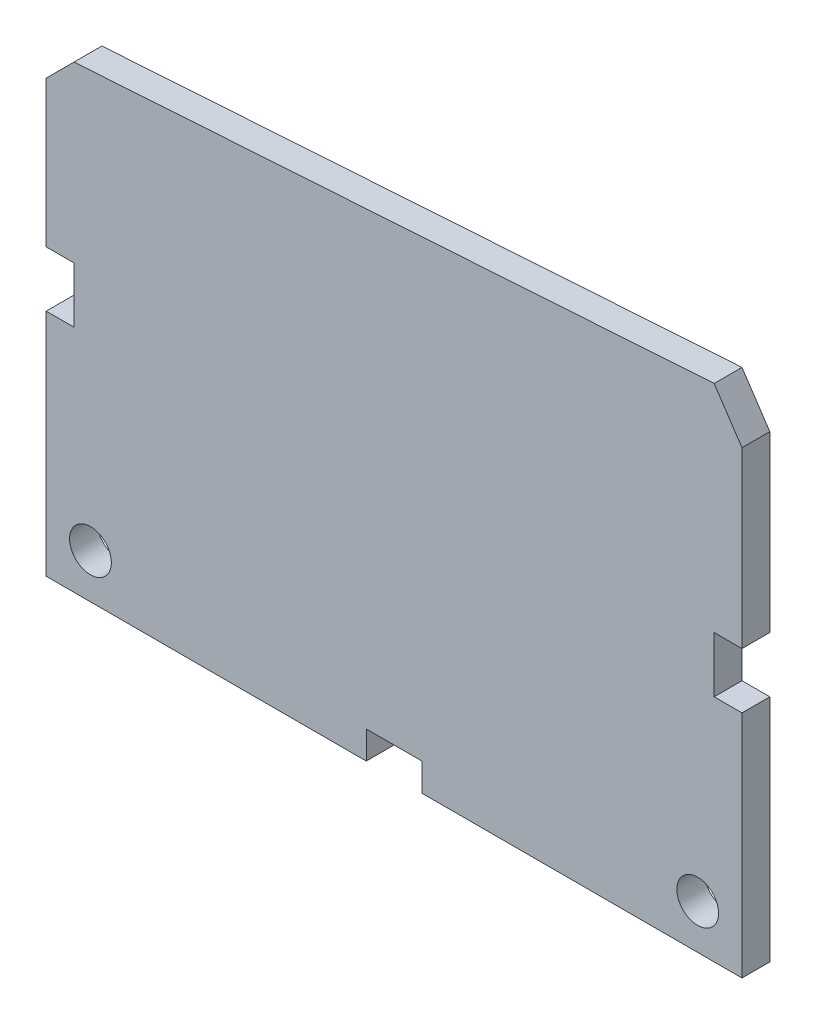
ISO-10303-21;
HEADER;
FILE_DESCRIPTION(('STEP AP214'),'2;1');
FILE_NAME('part.step','',(''),(''),'','','');
FILE_SCHEMA(('AUTOMOTIVE_DESIGN { 1 0 10303 214 1 1 1 1 }'));
ENDSEC;
DATA;
#1=APPLICATION_CONTEXT('core data for automotive mechanical design processes');
#2=APPLICATION_PROTOCOL_DEFINITION('international standard','automotive_design',2000,#1);
#3=PRODUCT_CONTEXT('',#1,'mechanical');
#4=PRODUCT('Part','Part','',(#3));
#5=PRODUCT_RELATED_PRODUCT_CATEGORY('part','',(#4));
#6=PRODUCT_DEFINITION_FORMATION('','',#4);
#7=PRODUCT_DEFINITION_CONTEXT('part definition',#1,'design');
#8=PRODUCT_DEFINITION('design','',#6,#7);
#9=PRODUCT_DEFINITION_SHAPE('','',#8);
#10=(LENGTH_UNIT() NAMED_UNIT(*) SI_UNIT(.MILLI.,.METRE.));
#11=(NAMED_UNIT(*) PLANE_ANGLE_UNIT() SI_UNIT($,.RADIAN.));
#12=(NAMED_UNIT(*) SI_UNIT($,.STERADIAN.) SOLID_ANGLE_UNIT());
#13=UNCERTAINTY_MEASURE_WITH_UNIT(LENGTH_MEASURE(1.E-05),#10,'distance_accuracy_value','');
#14=(GEOMETRIC_REPRESENTATION_CONTEXT(3) GLOBAL_UNCERTAINTY_ASSIGNED_CONTEXT((#13)) GLOBAL_UNIT_ASSIGNED_CONTEXT((#10,
#11,#12)) REPRESENTATION_CONTEXT('',''));
#15=CARTESIAN_POINT('',(0.,0.,0.));
#16=DIRECTION('',(0.,0.,1.));
#17=DIRECTION('',(1.,0.,0.));
#18=AXIS2_PLACEMENT_3D('',#15,#16,#17);
#19=CARTESIAN_POINT('',(50.,-33.,24.));
#20=DIRECTION('',(-1.,0.,0.));
#21=DIRECTION('',(0.,0.,1.));
#22=AXIS2_PLACEMENT_3D('',#19,#20,#21);
#23=PLANE('',#22);
#24=DIRECTION('',(0.,1.,0.));
#25=VECTOR('',#24,1.);
#26=CARTESIAN_POINT('',(50.,-33.,22.));
#27=LINE('',#26,#25);
#28=CARTESIAN_POINT('',(50.,-33.,22.));
#29=VERTEX_POINT('',#28);
#30=CARTESIAN_POINT('',(50.,-16.5,22.));
#31=VERTEX_POINT('',#30);
#32=EDGE_CURVE('E4459',#29,#31,#27,.T.);
#33=ORIENTED_EDGE('',*,*,#32,.T.);
#34=DIRECTION('',(0.,0.,1.));
#35=VECTOR('',#34,1.);
#36=CARTESIAN_POINT('',(50.,-16.5,22.));
#37=LINE('',#36,#35);
#38=CARTESIAN_POINT('',(50.,-16.5,24.));
#39=VERTEX_POINT('',#38);
#40=EDGE_CURVE('E4355',#31,#39,#37,.T.);
#41=ORIENTED_EDGE('',*,*,#40,.T.);
#42=DIRECTION('',(0.,1.,0.));
#43=VECTOR('',#42,1.);
#44=CARTESIAN_POINT('',(50.,-33.,24.));
#45=LINE('',#44,#43);
#46=CARTESIAN_POINT('',(50.,-33.,24.));
#47=VERTEX_POINT('',#46);
#48=EDGE_CURVE('E4438',#47,#39,#45,.T.);
#49=ORIENTED_EDGE('',*,*,#48,.F.);
#50=DIRECTION('',(0.,0.,-1.));
#51=VECTOR('',#50,1.);
#52=CARTESIAN_POINT('',(50.,-33.,24.));
#53=LINE('',#52,#51);
#54=EDGE_CURVE('E4310',#47,#29,#53,.T.);
#55=ORIENTED_EDGE('',*,*,#54,.T.);
#56=EDGE_LOOP('',(#33,#41,#49,#55));
#57=FACE_BOUND('',#56,.T.);
#58=ADVANCED_FACE('F4140',(#57),#23,.F.);
#59=CARTESIAN_POINT('',(0.,-2.00000000000001,24.));
#60=DIRECTION('',(1.,0.,0.));
#61=DIRECTION('',(0.,1.,0.));
#62=AXIS2_PLACEMENT_3D('',#59,#60,#61);
#63=PLANE('',#62);
#64=DIRECTION('',(0.,-1.,0.));
#65=VECTOR('',#64,1.);
#66=CARTESIAN_POINT('',(0.,-2.00000000000001,22.));
#67=LINE('',#66,#65);
#68=CARTESIAN_POINT('',(0.,-2.00000000000001,22.));
#69=VERTEX_POINT('',#68);
#70=CARTESIAN_POINT('',(0.,-12.5,22.));
#71=VERTEX_POINT('',#70);
#72=EDGE_CURVE('E4296',#69,#71,#67,.T.);
#73=ORIENTED_EDGE('',*,*,#72,.T.);
#74=DIRECTION('',(0.,0.,1.));
#75=VECTOR('',#74,1.);
#76=CARTESIAN_POINT('',(0.,-12.5,22.));
#77=LINE('',#76,#75);
#78=CARTESIAN_POINT('',(0.,-12.5,24.));
#79=VERTEX_POINT('',#78);
#80=EDGE_CURVE('E4361',#71,#79,#77,.T.);
#81=ORIENTED_EDGE('',*,*,#80,.T.);
#82=DIRECTION('',(0.,-1.,0.));
#83=VECTOR('',#82,1.);
#84=CARTESIAN_POINT('',(0.,-2.00000000000001,24.));
#85=LINE('',#84,#83);
#86=CARTESIAN_POINT('',(0.,-2.00000000000001,24.));
#87=VERTEX_POINT('',#86);
#88=EDGE_CURVE('E4451',#87,#79,#85,.T.);
#89=ORIENTED_EDGE('',*,*,#88,.F.);
#90=DIRECTION('',(0.,0.,-1.));
#91=VECTOR('',#90,1.);
#92=CARTESIAN_POINT('',(0.,-2.00000000000001,24.));
#93=LINE('',#92,#91);
#94=EDGE_CURVE('E4318',#87,#69,#93,.T.);
#95=ORIENTED_EDGE('',*,*,#94,.T.);
#96=EDGE_LOOP('',(#73,#81,#89,#95));
#97=FACE_BOUND('',#96,.T.);
#98=ADVANCED_FACE('F4481',(#97),#63,.F.);
#99=CARTESIAN_POINT('',(0.,-33.,24.));
#100=DIRECTION('',(0.,1.,0.));
#101=DIRECTION('',(0.,0.,1.));
#102=AXIS2_PLACEMENT_3D('',#99,#100,#101);
#103=PLANE('',#102);
#104=DIRECTION('',(1.,0.,0.));
#105=VECTOR('',#104,1.);
#106=CARTESIAN_POINT('',(0.,-33.,22.));
#107=LINE('',#106,#105);
#108=CARTESIAN_POINT('',(0.,-33.,22.));
#109=VERTEX_POINT('',#108);
#110=CARTESIAN_POINT('',(23.,-33.,22.));
#111=VERTEX_POINT('',#110);
#112=EDGE_CURVE('E4294',#109,#111,#107,.T.);
#113=ORIENTED_EDGE('',*,*,#112,.T.);
#114=DIRECTION('',(0.,0.,1.));
#115=VECTOR('',#114,1.);
#116=CARTESIAN_POINT('',(23.,-33.,22.));
#117=LINE('',#116,#115);
#118=CARTESIAN_POINT('',(23.,-33.,24.));
#119=VERTEX_POINT('',#118);
#120=EDGE_CURVE('E4388',#111,#119,#117,.T.);
#121=ORIENTED_EDGE('',*,*,#120,.T.);
#122=DIRECTION('',(1.,0.,0.));
#123=VECTOR('',#122,1.);
#124=CARTESIAN_POINT('',(0.,-33.,24.));
#125=LINE('',#124,#123);
#126=CARTESIAN_POINT('',(0.,-33.,24.));
#127=VERTEX_POINT('',#126);
#128=EDGE_CURVE('E4315',#127,#119,#125,.T.);
#129=ORIENTED_EDGE('',*,*,#128,.F.);
#130=DIRECTION('',(0.,0.,-1.));
#131=VECTOR('',#130,1.);
#132=CARTESIAN_POINT('',(0.,-33.,24.));
#133=LINE('',#132,#131);
#134=EDGE_CURVE('E4314',#127,#109,#133,.T.);
#135=ORIENTED_EDGE('',*,*,#134,.T.);
#136=EDGE_LOOP('',(#113,#121,#129,#135));
#137=FACE_BOUND('',#136,.T.);
#138=ADVANCED_FACE('F4531',(#137),#103,.F.);
#139=CARTESIAN_POINT('',(50.,-12.5,24.));
#140=VERTEX_POINT('',#139);
#141=CARTESIAN_POINT('',(50.,0.,24.));
#142=VERTEX_POINT('',#141);
#143=EDGE_CURVE('E4309',#140,#142,#45,.T.);
#144=ORIENTED_EDGE('',*,*,#143,.F.);
#145=DIRECTION('',(0.,0.,1.));
#146=VECTOR('',#145,1.);
#147=CARTESIAN_POINT('',(50.,-12.5,22.));
#148=LINE('',#147,#146);
#149=CARTESIAN_POINT('',(50.,-12.5,22.));
#150=VERTEX_POINT('',#149);
#151=EDGE_CURVE('E4382',#150,#140,#148,.T.);
#152=ORIENTED_EDGE('',*,*,#151,.F.);
#153=CARTESIAN_POINT('',(50.,0.,22.));
#154=VERTEX_POINT('',#153);
#155=EDGE_CURVE('E4365',#150,#154,#27,.T.);
#156=ORIENTED_EDGE('',*,*,#155,.T.);
#157=DIRECTION('',(0.,0.,-1.));
#158=VECTOR('',#157,1.);
#159=CARTESIAN_POINT('',(50.,0.,24.));
#160=LINE('',#159,#158);
#161=EDGE_CURVE('E13',#142,#154,#160,.T.);
#162=ORIENTED_EDGE('',*,*,#161,.F.);
#163=EDGE_LOOP('',(#144,#152,#156,#162));
#164=FACE_BOUND('',#163,.T.);
#165=ADVANCED_FACE('F4142',(#164),#23,.F.);
#166=CARTESIAN_POINT('',(50.,0.,24.));
#167=DIRECTION('',(-0.832050294337843,-0.554700196225229,0.));
#168=DIRECTION('',(0.554700196225229,-0.832050294337843,0.));
#169=AXIS2_PLACEMENT_3D('',#166,#167,#168);
#170=PLANE('',#169);
#171=DIRECTION('',(-0.554700196225229,0.832050294337843,0.));
#172=VECTOR('',#171,1.);
#173=CARTESIAN_POINT('',(50.,0.,22.));
#174=LINE('',#173,#172);
#175=CARTESIAN_POINT('',(48.,3.,22.));
#176=VERTEX_POINT('',#175);
#177=EDGE_CURVE('E4463',#154,#176,#174,.T.);
#178=ORIENTED_EDGE('',*,*,#177,.T.);
#179=DIRECTION('',(0.,0.,-1.));
#180=VECTOR('',#179,1.);
#181=CARTESIAN_POINT('',(48.,3.,24.));
#182=LINE('',#181,#180);
#183=CARTESIAN_POINT('',(48.,3.,24.));
#184=VERTEX_POINT('',#183);
#185=EDGE_CURVE('E4150',#184,#176,#182,.T.);
#186=ORIENTED_EDGE('',*,*,#185,.F.);
#187=DIRECTION('',(-0.554700196225229,0.832050294337843,0.));
#188=VECTOR('',#187,1.);
#189=CARTESIAN_POINT('',(50.,0.,24.));
#190=LINE('',#189,#188);
#191=EDGE_CURVE('E4442',#142,#184,#190,.T.);
#192=ORIENTED_EDGE('',*,*,#191,.F.);
#193=ORIENTED_EDGE('',*,*,#161,.T.);
#194=EDGE_LOOP('',(#178,#186,#192,#193));
#195=FACE_BOUND('',#194,.T.);
#196=ADVANCED_FACE('F4492',(#195),#170,.F.);
#197=CARTESIAN_POINT('',(48.,3.,24.));
#198=DIRECTION('',(0.0650791373455969,-0.997880105965818,0.));
#199=DIRECTION('',(0.997880105965818,0.0650791373455969,0.));
#200=AXIS2_PLACEMENT_3D('',#197,#198,#199);
#201=PLANE('',#200);
#202=DIRECTION('',(-0.997880105965818,-0.0650791373455969,0.));
#203=VECTOR('',#202,1.);
#204=CARTESIAN_POINT('',(48.,3.,22.));
#205=LINE('',#204,#203);
#206=CARTESIAN_POINT('',(2.,0.,22.));
#207=VERTEX_POINT('',#206);
#208=EDGE_CURVE('E4303',#176,#207,#205,.T.);
#209=ORIENTED_EDGE('',*,*,#208,.T.);
#210=DIRECTION('',(0.,0.,-1.));
#211=VECTOR('',#210,1.);
#212=CARTESIAN_POINT('',(2.,0.,24.));
#213=LINE('',#212,#211);
#214=CARTESIAN_POINT('',(2.,0.,24.));
#215=VERTEX_POINT('',#214);
#216=EDGE_CURVE('E4322',#215,#207,#213,.T.);
#217=ORIENTED_EDGE('',*,*,#216,.F.);
#218=DIRECTION('',(-0.997880105965818,-0.0650791373455969,0.));
#219=VECTOR('',#218,1.);
#220=CARTESIAN_POINT('',(48.,3.,24.));
#221=LINE('',#220,#219);
#222=EDGE_CURVE('E4445',#184,#215,#221,.T.);
#223=ORIENTED_EDGE('',*,*,#222,.F.);
#224=ORIENTED_EDGE('',*,*,#185,.T.);
#225=EDGE_LOOP('',(#209,#217,#223,#224));
#226=FACE_BOUND('',#225,.T.);
#227=ADVANCED_FACE('F4469',(#226),#201,.F.);
#228=CARTESIAN_POINT('',(2.,0.,24.));
#229=DIRECTION('',(0.707106781186549,-0.707106781186546,0.));
#230=DIRECTION('',(0.707106781186546,0.707106781186549,0.));
#231=AXIS2_PLACEMENT_3D('',#228,#229,#230);
#232=PLANE('',#231);
#233=DIRECTION('',(-0.707106781186546,-0.707106781186549,0.));
#234=VECTOR('',#233,1.);
#235=CARTESIAN_POINT('',(2.,0.,22.));
#236=LINE('',#235,#234);
#237=EDGE_CURVE('E4297',#207,#69,#236,.T.);
#238=ORIENTED_EDGE('',*,*,#237,.T.);
#239=ORIENTED_EDGE('',*,*,#94,.F.);
#240=DIRECTION('',(-0.707106781186546,-0.707106781186549,0.));
#241=VECTOR('',#240,1.);
#242=CARTESIAN_POINT('',(2.,0.,24.));
#243=LINE('',#242,#241);
#244=EDGE_CURVE('E4448',#215,#87,#243,.T.);
#245=ORIENTED_EDGE('',*,*,#244,.F.);
#246=ORIENTED_EDGE('',*,*,#216,.T.);
#247=EDGE_LOOP('',(#238,#239,#245,#246));
#248=FACE_BOUND('',#247,.T.);
#249=ADVANCED_FACE('F4476',(#248),#232,.F.);
#250=CARTESIAN_POINT('',(0.,-16.5,24.));
#251=VERTEX_POINT('',#250);
#252=EDGE_CURVE('E4285',#251,#127,#85,.T.);
#253=ORIENTED_EDGE('',*,*,#252,.F.);
#254=DIRECTION('',(0.,0.,1.));
#255=VECTOR('',#254,1.);
#256=CARTESIAN_POINT('',(0.,-16.5,22.));
#257=LINE('',#256,#255);
#258=CARTESIAN_POINT('',(0.,-16.5,22.));
#259=VERTEX_POINT('',#258);
#260=EDGE_CURVE('E4271',#259,#251,#257,.T.);
#261=ORIENTED_EDGE('',*,*,#260,.F.);
#262=EDGE_CURVE('E4283',#259,#109,#67,.T.);
#263=ORIENTED_EDGE('',*,*,#262,.T.);
#264=ORIENTED_EDGE('',*,*,#134,.F.);
#265=EDGE_LOOP('',(#253,#261,#263,#264));
#266=FACE_BOUND('',#265,.T.);
#267=ADVANCED_FACE('F4281',(#266),#63,.F.);
#268=CARTESIAN_POINT('',(27.,-33.,24.));
#269=VERTEX_POINT('',#268);
#270=EDGE_CURVE('E4455',#269,#47,#125,.T.);
#271=ORIENTED_EDGE('',*,*,#270,.F.);
#272=DIRECTION('',(0.,0.,1.));
#273=VECTOR('',#272,1.);
#274=CARTESIAN_POINT('',(27.,-33.,22.));
#275=LINE('',#274,#273);
#276=CARTESIAN_POINT('',(27.,-33.,22.));
#277=VERTEX_POINT('',#276);
#278=EDGE_CURVE('E4417',#277,#269,#275,.T.);
#279=ORIENTED_EDGE('',*,*,#278,.F.);
#280=EDGE_CURVE('E4302',#277,#29,#107,.T.);
#281=ORIENTED_EDGE('',*,*,#280,.T.);
#282=ORIENTED_EDGE('',*,*,#54,.F.);
#283=EDGE_LOOP('',(#271,#279,#281,#282));
#284=FACE_BOUND('',#283,.T.);
#285=ADVANCED_FACE('F4512',(#284),#103,.F.);
#286=CARTESIAN_POINT('',(0.,0.,24.));
#287=DIRECTION('',(0.,0.,-1.));
#288=DIRECTION('',(-1.,0.,0.));
#289=AXIS2_PLACEMENT_3D('',#286,#287,#288);
#290=PLANE('',#289);
#291=CARTESIAN_POINT('',(3.18198051533946,-29.8180194846605,24.));
#292=DIRECTION('',(0.,0.,1.));
#293=DIRECTION('',(1.,0.,0.));
#294=AXIS2_PLACEMENT_3D('',#291,#292,#293);
#295=CIRCLE('',#294,1.5);
#296=CARTESIAN_POINT('',(4.68198051533946,-29.8180194846605,24.));
#297=VERTEX_POINT('',#296);
#298=EDGE_CURVE('E4331',#297,#297,#295,.T.);
#299=ORIENTED_EDGE('',*,*,#298,.F.);
#300=EDGE_LOOP('',(#299));
#301=FACE_BOUND('',#300,.T.);
#302=CARTESIAN_POINT('',(46.8180194846605,-29.8180194846605,24.));
#303=DIRECTION('',(0.,0.,1.));
#304=DIRECTION('',(-1.,0.,0.));
#305=AXIS2_PLACEMENT_3D('',#302,#303,#304);
#306=CIRCLE('',#305,1.5);
#307=CARTESIAN_POINT('',(45.3180194846605,-29.8180194846605,24.));
#308=VERTEX_POINT('',#307);
#309=EDGE_CURVE('E4339',#308,#308,#306,.T.);
#310=ORIENTED_EDGE('',*,*,#309,.F.);
#311=EDGE_LOOP('',(#310));
#312=FACE_BOUND('',#311,.T.);
#313=ORIENTED_EDGE('',*,*,#88,.T.);
#314=DIRECTION('',(-1.,0.,0.));
#315=VECTOR('',#314,1.);
#316=CARTESIAN_POINT('',(0.,-12.5,24.));
#317=LINE('',#316,#315);
#318=CARTESIAN_POINT('',(2.,-12.5,24.));
#319=VERTEX_POINT('',#318);
#320=EDGE_CURVE('E4277',#319,#79,#317,.T.);
#321=ORIENTED_EDGE('',*,*,#320,.F.);
#322=DIRECTION('',(0.,1.,0.));
#323=VECTOR('',#322,1.);
#324=CARTESIAN_POINT('',(2.,-12.5,24.));
#325=LINE('',#324,#323);
#326=CARTESIAN_POINT('',(2.,-16.5,24.));
#327=VERTEX_POINT('',#326);
#328=EDGE_CURVE('E4354',#327,#319,#325,.T.);
#329=ORIENTED_EDGE('',*,*,#328,.F.);
#330=DIRECTION('',(1.,0.,0.));
#331=VECTOR('',#330,1.);
#332=CARTESIAN_POINT('',(0.,-16.5,24.));
#333=LINE('',#332,#331);
#334=EDGE_CURVE('E4351',#251,#327,#333,.T.);
#335=ORIENTED_EDGE('',*,*,#334,.F.);
#336=ORIENTED_EDGE('',*,*,#252,.T.);
#337=ORIENTED_EDGE('',*,*,#128,.T.);
#338=DIRECTION('',(0.,-1.,0.));
#339=VECTOR('',#338,1.);
#340=CARTESIAN_POINT('',(23.,-31.,24.));
#341=LINE('',#340,#339);
#342=CARTESIAN_POINT('',(23.,-31.,24.));
#343=VERTEX_POINT('',#342);
#344=EDGE_CURVE('E4410',#343,#119,#341,.T.);
#345=ORIENTED_EDGE('',*,*,#344,.F.);
#346=DIRECTION('',(-1.,0.,0.));
#347=VECTOR('',#346,1.);
#348=CARTESIAN_POINT('',(27.,-31.,24.));
#349=LINE('',#348,#347);
#350=CARTESIAN_POINT('',(27.,-31.,24.));
#351=VERTEX_POINT('',#350);
#352=EDGE_CURVE('E4421',#351,#343,#349,.T.);
#353=ORIENTED_EDGE('',*,*,#352,.F.);
#354=DIRECTION('',(0.,1.,0.));
#355=VECTOR('',#354,1.);
#356=CARTESIAN_POINT('',(27.,-33.,24.));
#357=LINE('',#356,#355);
#358=EDGE_CURVE('E4337',#269,#351,#357,.T.);
#359=ORIENTED_EDGE('',*,*,#358,.F.);
#360=ORIENTED_EDGE('',*,*,#270,.T.);
#361=ORIENTED_EDGE('',*,*,#48,.T.);
#362=DIRECTION('',(1.,0.,0.));
#363=VECTOR('',#362,1.);
#364=CARTESIAN_POINT('',(50.,-16.5,24.));
#365=LINE('',#364,#363);
#366=CARTESIAN_POINT('',(48.,-16.5,24.));
#367=VERTEX_POINT('',#366);
#368=EDGE_CURVE('E4375',#367,#39,#365,.T.);
#369=ORIENTED_EDGE('',*,*,#368,.F.);
#370=DIRECTION('',(0.,-1.,0.));
#371=VECTOR('',#370,1.);
#372=CARTESIAN_POINT('',(48.,-12.5,24.));
#373=LINE('',#372,#371);
#374=CARTESIAN_POINT('',(48.,-12.5,24.));
#375=VERTEX_POINT('',#374);
#376=EDGE_CURVE('E4387',#375,#367,#373,.T.);
#377=ORIENTED_EDGE('',*,*,#376,.F.);
#378=DIRECTION('',(-1.,0.,0.));
#379=VECTOR('',#378,1.);
#380=CARTESIAN_POINT('',(50.,-12.5,24.));
#381=LINE('',#380,#379);
#382=EDGE_CURVE('E4383',#140,#375,#381,.T.);
#383=ORIENTED_EDGE('',*,*,#382,.F.);
#384=ORIENTED_EDGE('',*,*,#143,.T.);
#385=ORIENTED_EDGE('',*,*,#191,.T.);
#386=ORIENTED_EDGE('',*,*,#222,.T.);
#387=ORIENTED_EDGE('',*,*,#244,.T.);
#388=EDGE_LOOP('',(#313,#321,#329,#335,#336,#337,#345,#353,#359,#360,#361,#369,#377,#383,#384,
#385,#386,#387));
#389=FACE_BOUND('',#388,.T.);
#390=ADVANCED_FACE('F4485',(#301,#312,#389),#290,.F.);
#391=CARTESIAN_POINT('',(0.,0.,22.));
#392=DIRECTION('',(0.,0.,-1.));
#393=DIRECTION('',(-1.,0.,0.));
#394=AXIS2_PLACEMENT_3D('',#391,#392,#393);
#395=PLANE('',#394);
#396=CARTESIAN_POINT('',(3.18198051533946,-29.8180194846605,22.));
#397=DIRECTION('',(0.,0.,-1.));
#398=DIRECTION('',(-1.,0.,0.));
#399=AXIS2_PLACEMENT_3D('',#396,#397,#398);
#400=CIRCLE('',#399,1.5);
#401=CARTESIAN_POINT('',(1.68198051533946,-29.8180194846605,22.));
#402=VERTEX_POINT('',#401);
#403=EDGE_CURVE('E4144',#402,#402,#400,.T.);
#404=ORIENTED_EDGE('',*,*,#403,.F.);
#405=EDGE_LOOP('',(#404));
#406=FACE_BOUND('',#405,.T.);
#407=CARTESIAN_POINT('',(46.8180194846605,-29.8180194846605,22.));
#408=DIRECTION('',(0.,0.,-1.));
#409=DIRECTION('',(-1.,0.,0.));
#410=AXIS2_PLACEMENT_3D('',#407,#408,#409);
#411=CIRCLE('',#410,1.5);
#412=CARTESIAN_POINT('',(45.3180194846605,-29.8180194846605,22.));
#413=VERTEX_POINT('',#412);
#414=EDGE_CURVE('E4328',#413,#413,#411,.T.);
#415=ORIENTED_EDGE('',*,*,#414,.F.);
#416=EDGE_LOOP('',(#415));
#417=FACE_BOUND('',#416,.T.);
#418=DIRECTION('',(-1.,0.,0.));
#419=VECTOR('',#418,1.);
#420=CARTESIAN_POINT('',(0.,-12.5,22.));
#421=LINE('',#420,#419);
#422=CARTESIAN_POINT('',(2.,-12.5,22.));
#423=VERTEX_POINT('',#422);
#424=EDGE_CURVE('E4287',#423,#71,#421,.T.);
#425=ORIENTED_EDGE('',*,*,#424,.T.);
#426=ORIENTED_EDGE('',*,*,#72,.F.);
#427=ORIENTED_EDGE('',*,*,#237,.F.);
#428=ORIENTED_EDGE('',*,*,#208,.F.);
#429=ORIENTED_EDGE('',*,*,#177,.F.);
#430=ORIENTED_EDGE('',*,*,#155,.F.);
#431=DIRECTION('',(-1.,0.,0.));
#432=VECTOR('',#431,1.);
#433=CARTESIAN_POINT('',(50.,-12.5,22.));
#434=LINE('',#433,#432);
#435=CARTESIAN_POINT('',(48.,-12.5,22.));
#436=VERTEX_POINT('',#435);
#437=EDGE_CURVE('E4371',#150,#436,#434,.T.);
#438=ORIENTED_EDGE('',*,*,#437,.T.);
#439=DIRECTION('',(0.,-1.,0.));
#440=VECTOR('',#439,1.);
#441=CARTESIAN_POINT('',(48.,-12.5,22.));
#442=LINE('',#441,#440);
#443=CARTESIAN_POINT('',(48.,-16.5,22.));
#444=VERTEX_POINT('',#443);
#445=EDGE_CURVE('E4166',#436,#444,#442,.T.);
#446=ORIENTED_EDGE('',*,*,#445,.T.);
#447=DIRECTION('',(1.,0.,0.));
#448=VECTOR('',#447,1.);
#449=CARTESIAN_POINT('',(50.,-16.5,22.));
#450=LINE('',#449,#448);
#451=EDGE_CURVE('E4378',#444,#31,#450,.T.);
#452=ORIENTED_EDGE('',*,*,#451,.T.);
#453=ORIENTED_EDGE('',*,*,#32,.F.);
#454=ORIENTED_EDGE('',*,*,#280,.F.);
#455=DIRECTION('',(0.,1.,0.));
#456=VECTOR('',#455,1.);
#457=CARTESIAN_POINT('',(27.,-33.,22.));
#458=LINE('',#457,#456);
#459=CARTESIAN_POINT('',(27.,-31.,22.));
#460=VERTEX_POINT('',#459);
#461=EDGE_CURVE('E4405',#277,#460,#458,.T.);
#462=ORIENTED_EDGE('',*,*,#461,.T.);
#463=DIRECTION('',(-1.,0.,0.));
#464=VECTOR('',#463,1.);
#465=CARTESIAN_POINT('',(27.,-31.,22.));
#466=LINE('',#465,#464);
#467=CARTESIAN_POINT('',(23.,-31.,22.));
#468=VERTEX_POINT('',#467);
#469=EDGE_CURVE('E4409',#460,#468,#466,.T.);
#470=ORIENTED_EDGE('',*,*,#469,.T.);
#471=DIRECTION('',(0.,-1.,0.));
#472=VECTOR('',#471,1.);
#473=CARTESIAN_POINT('',(23.,-31.,22.));
#474=LINE('',#473,#472);
#475=EDGE_CURVE('E4414',#468,#111,#474,.T.);
#476=ORIENTED_EDGE('',*,*,#475,.T.);
#477=ORIENTED_EDGE('',*,*,#112,.F.);
#478=ORIENTED_EDGE('',*,*,#262,.F.);
#479=DIRECTION('',(1.,0.,0.));
#480=VECTOR('',#479,1.);
#481=CARTESIAN_POINT('',(0.,-16.5,22.));
#482=LINE('',#481,#480);
#483=CARTESIAN_POINT('',(2.,-16.5,22.));
#484=VERTEX_POINT('',#483);
#485=EDGE_CURVE('E4267',#259,#484,#482,.T.);
#486=ORIENTED_EDGE('',*,*,#485,.T.);
#487=DIRECTION('',(0.,1.,0.));
#488=VECTOR('',#487,1.);
#489=CARTESIAN_POINT('',(2.,-12.5,22.));
#490=LINE('',#489,#488);
#491=EDGE_CURVE('E4158',#484,#423,#490,.T.);
#492=ORIENTED_EDGE('',*,*,#491,.T.);
#493=EDGE_LOOP('',(#425,#426,#427,#428,#429,#430,#438,#446,#452,#453,#454,#462,#470,#476,#477,
#478,#486,#492));
#494=FACE_BOUND('',#493,.T.);
#495=ADVANCED_FACE('F4291',(#406,#417,#494),#395,.T.);
#496=CARTESIAN_POINT('',(23.,-31.,22.));
#497=DIRECTION('',(-1.,0.,0.));
#498=DIRECTION('',(0.,0.,1.));
#499=AXIS2_PLACEMENT_3D('',#496,#497,#498);
#500=PLANE('',#499);
#501=ORIENTED_EDGE('',*,*,#344,.T.);
#502=ORIENTED_EDGE('',*,*,#120,.F.);
#503=ORIENTED_EDGE('',*,*,#475,.F.);
#504=DIRECTION('',(0.,0.,1.));
#505=VECTOR('',#504,1.);
#506=CARTESIAN_POINT('',(23.,-31.,22.));
#507=LINE('',#506,#505);
#508=EDGE_CURVE('E4430',#468,#343,#507,.T.);
#509=ORIENTED_EDGE('',*,*,#508,.T.);
#510=EDGE_LOOP('',(#501,#502,#503,#509));
#511=FACE_BOUND('',#510,.T.);
#512=ADVANCED_FACE('F4528',(#511),#500,.F.);
#513=CARTESIAN_POINT('',(27.,-31.,22.));
#514=DIRECTION('',(0.,1.,0.));
#515=DIRECTION('',(0.,0.,1.));
#516=AXIS2_PLACEMENT_3D('',#513,#514,#515);
#517=PLANE('',#516);
#518=ORIENTED_EDGE('',*,*,#352,.T.);
#519=ORIENTED_EDGE('',*,*,#508,.F.);
#520=ORIENTED_EDGE('',*,*,#469,.F.);
#521=DIRECTION('',(0.,0.,1.));
#522=VECTOR('',#521,1.);
#523=CARTESIAN_POINT('',(27.,-31.,22.));
#524=LINE('',#523,#522);
#525=EDGE_CURVE('E4433',#460,#351,#524,.T.);
#526=ORIENTED_EDGE('',*,*,#525,.T.);
#527=EDGE_LOOP('',(#518,#519,#520,#526));
#528=FACE_BOUND('',#527,.T.);
#529=ADVANCED_FACE('F4526',(#528),#517,.F.);
#530=CARTESIAN_POINT('',(27.,-33.,22.));
#531=DIRECTION('',(1.,0.,0.));
#532=DIRECTION('',(0.,0.,-1.));
#533=AXIS2_PLACEMENT_3D('',#530,#531,#532);
#534=PLANE('',#533);
#535=ORIENTED_EDGE('',*,*,#358,.T.);
#536=ORIENTED_EDGE('',*,*,#525,.F.);
#537=ORIENTED_EDGE('',*,*,#461,.F.);
#538=ORIENTED_EDGE('',*,*,#278,.T.);
#539=EDGE_LOOP('',(#535,#536,#537,#538));
#540=FACE_BOUND('',#539,.T.);
#541=ADVANCED_FACE('F4523',(#540),#534,.F.);
#542=CARTESIAN_POINT('',(50.,-16.5,22.));
#543=DIRECTION('',(0.,-1.,0.));
#544=DIRECTION('',(0.,0.,-1.));
#545=AXIS2_PLACEMENT_3D('',#542,#543,#544);
#546=PLANE('',#545);
#547=ORIENTED_EDGE('',*,*,#368,.T.);
#548=ORIENTED_EDGE('',*,*,#40,.F.);
#549=ORIENTED_EDGE('',*,*,#451,.F.);
#550=DIRECTION('',(0.,0.,1.));
#551=VECTOR('',#550,1.);
#552=CARTESIAN_POINT('',(48.,-16.5,22.));
#553=LINE('',#552,#551);
#554=EDGE_CURVE('E4397',#444,#367,#553,.T.);
#555=ORIENTED_EDGE('',*,*,#554,.T.);
#556=EDGE_LOOP('',(#547,#548,#549,#555));
#557=FACE_BOUND('',#556,.T.);
#558=ADVANCED_FACE('F4504',(#557),#546,.F.);
#559=CARTESIAN_POINT('',(48.,-12.5,22.));
#560=DIRECTION('',(-1.,0.,0.));
#561=DIRECTION('',(0.,0.,1.));
#562=AXIS2_PLACEMENT_3D('',#559,#560,#561);
#563=PLANE('',#562);
#564=ORIENTED_EDGE('',*,*,#376,.T.);
#565=ORIENTED_EDGE('',*,*,#554,.F.);
#566=ORIENTED_EDGE('',*,*,#445,.F.);
#567=DIRECTION('',(0.,0.,1.));
#568=VECTOR('',#567,1.);
#569=CARTESIAN_POINT('',(48.,-12.5,22.));
#570=LINE('',#569,#568);
#571=EDGE_CURVE('E4400',#436,#375,#570,.T.);
#572=ORIENTED_EDGE('',*,*,#571,.T.);
#573=EDGE_LOOP('',(#564,#565,#566,#572));
#574=FACE_BOUND('',#573,.T.);
#575=ADVANCED_FACE('F4501',(#574),#563,.F.);
#576=CARTESIAN_POINT('',(50.,-12.5,22.));
#577=DIRECTION('',(0.,1.,0.));
#578=DIRECTION('',(0.,0.,1.));
#579=AXIS2_PLACEMENT_3D('',#576,#577,#578);
#580=PLANE('',#579);
#581=ORIENTED_EDGE('',*,*,#382,.T.);
#582=ORIENTED_EDGE('',*,*,#571,.F.);
#583=ORIENTED_EDGE('',*,*,#437,.F.);
#584=ORIENTED_EDGE('',*,*,#151,.T.);
#585=EDGE_LOOP('',(#581,#582,#583,#584));
#586=FACE_BOUND('',#585,.T.);
#587=ADVANCED_FACE('F4498',(#586),#580,.F.);
#588=CARTESIAN_POINT('',(0.,-12.5,22.));
#589=DIRECTION('',(0.,1.,0.));
#590=DIRECTION('',(0.,0.,1.));
#591=AXIS2_PLACEMENT_3D('',#588,#589,#590);
#592=PLANE('',#591);
#593=ORIENTED_EDGE('',*,*,#320,.T.);
#594=ORIENTED_EDGE('',*,*,#80,.F.);
#595=ORIENTED_EDGE('',*,*,#424,.F.);
#596=DIRECTION('',(0.,0.,1.));
#597=VECTOR('',#596,1.);
#598=CARTESIAN_POINT('',(2.,-12.5,22.));
#599=LINE('',#598,#597);
#600=EDGE_CURVE('E4366',#423,#319,#599,.T.);
#601=ORIENTED_EDGE('',*,*,#600,.T.);
#602=EDGE_LOOP('',(#593,#594,#595,#601));
#603=FACE_BOUND('',#602,.T.);
#604=ADVANCED_FACE('F4534',(#603),#592,.F.);
#605=CARTESIAN_POINT('',(2.,-12.5,22.));
#606=DIRECTION('',(1.,0.,0.));
#607=DIRECTION('',(0.,0.,-1.));
#608=AXIS2_PLACEMENT_3D('',#605,#606,#607);
#609=PLANE('',#608);
#610=ORIENTED_EDGE('',*,*,#328,.T.);
#611=ORIENTED_EDGE('',*,*,#600,.F.);
#612=ORIENTED_EDGE('',*,*,#491,.F.);
#613=DIRECTION('',(0.,0.,1.));
#614=VECTOR('',#613,1.);
#615=CARTESIAN_POINT('',(2.,-16.5,22.));
#616=LINE('',#615,#614);
#617=EDGE_CURVE('E4273',#484,#327,#616,.T.);
#618=ORIENTED_EDGE('',*,*,#617,.T.);
#619=EDGE_LOOP('',(#610,#611,#612,#618));
#620=FACE_BOUND('',#619,.T.);
#621=ADVANCED_FACE('F4532',(#620),#609,.F.);
#622=CARTESIAN_POINT('',(0.,-16.5,22.));
#623=DIRECTION('',(0.,-1.,0.));
#624=DIRECTION('',(0.,0.,-1.));
#625=AXIS2_PLACEMENT_3D('',#622,#623,#624);
#626=PLANE('',#625);
#627=ORIENTED_EDGE('',*,*,#334,.T.);
#628=ORIENTED_EDGE('',*,*,#617,.F.);
#629=ORIENTED_EDGE('',*,*,#485,.F.);
#630=ORIENTED_EDGE('',*,*,#260,.T.);
#631=EDGE_LOOP('',(#627,#628,#629,#630));
#632=FACE_BOUND('',#631,.T.);
#633=ADVANCED_FACE('F4270',(#632),#626,.F.);
#634=CARTESIAN_POINT('',(46.8180194846605,-29.8180194846605,14.));
#635=DIRECTION('',(0.,0.,1.));
#636=DIRECTION('',(1.,0.,0.));
#637=AXIS2_PLACEMENT_3D('',#634,#635,#636);
#638=CYLINDRICAL_SURFACE('',#637,1.5);
#639=ORIENTED_EDGE('',*,*,#414,.T.);
#640=EDGE_LOOP('',(#639));
#641=FACE_BOUND('',#640,.T.);
#642=ORIENTED_EDGE('',*,*,#309,.T.);
#643=EDGE_LOOP('',(#642));
#644=FACE_BOUND('',#643,.T.);
#645=ADVANCED_FACE('F4674',(#641,#644),#638,.F.);
#646=CARTESIAN_POINT('',(3.18198051533946,-29.8180194846605,14.));
#647=DIRECTION('',(0.,0.,1.));
#648=DIRECTION('',(1.,0.,0.));
#649=AXIS2_PLACEMENT_3D('',#646,#647,#648);
#650=CYLINDRICAL_SURFACE('',#649,1.5);
#651=ORIENTED_EDGE('',*,*,#403,.T.);
#652=EDGE_LOOP('',(#651));
#653=FACE_BOUND('',#652,.T.);
#654=ORIENTED_EDGE('',*,*,#298,.T.);
#655=EDGE_LOOP('',(#654));
#656=FACE_BOUND('',#655,.T.);
#657=ADVANCED_FACE('F4690',(#653,#656),#650,.F.);
#658=CLOSED_SHELL('',(#58,#98,#138,#165,#196,#227,#249,#267,#285,#390,#495,#512,#529,#541,#558,
#575,#587,#604,#621,#633,#645,#657));
#659=MANIFOLD_SOLID_BREP('B2',#658);
#660=ADVANCED_BREP_SHAPE_REPRESENTATION('',(#18,#659),#14);
#661=SHAPE_DEFINITION_REPRESENTATION(#9,#660);
ENDSEC;
END-ISO-10303-21;
